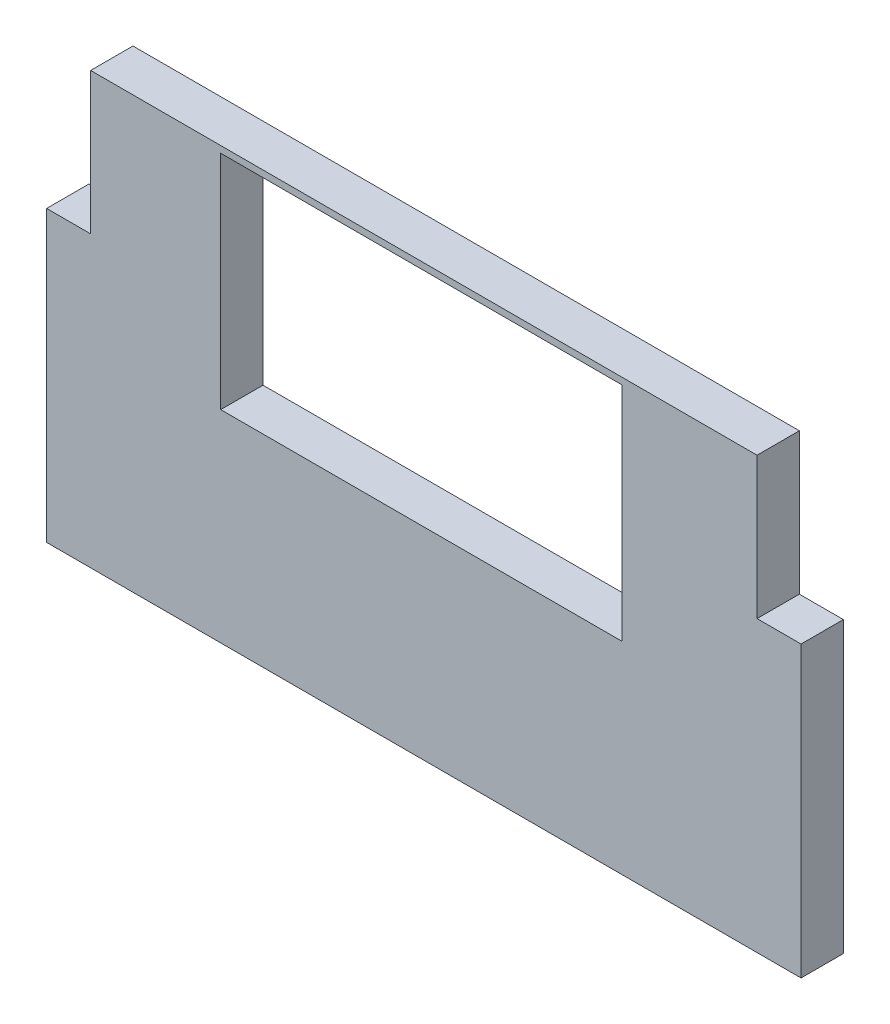
ISO-10303-21;
HEADER;
FILE_DESCRIPTION(('STEP AP214'),'2;1');
FILE_NAME('part.step','',(''),(''),'','','');
FILE_SCHEMA(('AUTOMOTIVE_DESIGN { 1 0 10303 214 1 1 1 1 }'));
ENDSEC;
DATA;
#1=APPLICATION_CONTEXT('core data for automotive mechanical design processes');
#2=APPLICATION_PROTOCOL_DEFINITION('international standard','automotive_design',2000,#1);
#3=PRODUCT_CONTEXT('',#1,'mechanical');
#4=PRODUCT('Part','Part','',(#3));
#5=PRODUCT_RELATED_PRODUCT_CATEGORY('part','',(#4));
#6=PRODUCT_DEFINITION_FORMATION('','',#4);
#7=PRODUCT_DEFINITION_CONTEXT('part definition',#1,'design');
#8=PRODUCT_DEFINITION('design','',#6,#7);
#9=PRODUCT_DEFINITION_SHAPE('','',#8);
#10=(LENGTH_UNIT() NAMED_UNIT(*) SI_UNIT(.MILLI.,.METRE.));
#11=(NAMED_UNIT(*) PLANE_ANGLE_UNIT() SI_UNIT($,.RADIAN.));
#12=(NAMED_UNIT(*) SI_UNIT($,.STERADIAN.) SOLID_ANGLE_UNIT());
#13=UNCERTAINTY_MEASURE_WITH_UNIT(LENGTH_MEASURE(1.E-05),#10,'distance_accuracy_value','');
#14=(GEOMETRIC_REPRESENTATION_CONTEXT(3) GLOBAL_UNCERTAINTY_ASSIGNED_CONTEXT((#13)) GLOBAL_UNIT_ASSIGNED_CONTEXT((#10,
#11,#12)) REPRESENTATION_CONTEXT('',''));
#15=CARTESIAN_POINT('',(0.,0.,0.));
#16=DIRECTION('',(0.,0.,1.));
#17=DIRECTION('',(1.,0.,0.));
#18=AXIS2_PLACEMENT_3D('',#15,#16,#17);
#19=CARTESIAN_POINT('',(0.,0.,3.175));
#20=DIRECTION('',(0.,0.,-1.));
#21=DIRECTION('',(-1.,0.,0.));
#22=AXIS2_PLACEMENT_3D('',#19,#20,#21);
#23=PLANE('',#22);
#24=DIRECTION('',(1.,0.,0.));
#25=VECTOR('',#24,1.);
#26=CARTESIAN_POINT('',(48.9804120830226,2.21128549851933,3.175));
#27=LINE('',#26,#25);
#28=CARTESIAN_POINT('',(-7.62358791697743,2.21128549851933,3.175));
#29=VERTEX_POINT('',#28);
#30=CARTESIAN_POINT('',(48.9804120830226,2.21128549851933,3.175));
#31=VERTEX_POINT('',#30);
#32=EDGE_CURVE('E177',#29,#31,#27,.T.);
#33=ORIENTED_EDGE('',*,*,#32,.T.);
#34=DIRECTION('',(0.,1.,0.));
#35=VECTOR('',#34,1.);
#36=CARTESIAN_POINT('',(48.9804120830226,23.9132855285193,3.175));
#37=LINE('',#36,#35);
#38=CARTESIAN_POINT('',(48.9804120830226,23.9132855285193,3.175));
#39=VERTEX_POINT('',#38);
#40=EDGE_CURVE('E181',#31,#39,#37,.T.);
#41=ORIENTED_EDGE('',*,*,#40,.T.);
#42=DIRECTION('',(-1.,0.,0.));
#43=VECTOR('',#42,1.);
#44=CARTESIAN_POINT('',(45.6784120830226,23.9132855285193,3.175));
#45=LINE('',#44,#43);
#46=CARTESIAN_POINT('',(45.6784120830226,23.9132855285193,3.175));
#47=VERTEX_POINT('',#46);
#48=EDGE_CURVE('E185',#39,#47,#45,.T.);
#49=ORIENTED_EDGE('',*,*,#48,.T.);
#50=DIRECTION('',(0.,1.,0.));
#51=VECTOR('',#50,1.);
#52=CARTESIAN_POINT('',(45.6784120830226,34.5312854985193,3.175));
#53=LINE('',#52,#51);
#54=CARTESIAN_POINT('',(45.6784120830226,34.5312854985193,3.175));
#55=VERTEX_POINT('',#54);
#56=EDGE_CURVE('E188',#47,#55,#53,.T.);
#57=ORIENTED_EDGE('',*,*,#56,.T.);
#58=DIRECTION('',(-1.,0.,0.));
#59=VECTOR('',#58,1.);
#60=CARTESIAN_POINT('',(-4.32158791697743,34.5312854985193,3.175));
#61=LINE('',#60,#59);
#62=CARTESIAN_POINT('',(-4.32158791697743,34.5312854985193,3.175));
#63=VERTEX_POINT('',#62);
#64=EDGE_CURVE('E191',#55,#63,#61,.T.);
#65=ORIENTED_EDGE('',*,*,#64,.T.);
#66=DIRECTION('',(0.,-1.,0.));
#67=VECTOR('',#66,1.);
#68=CARTESIAN_POINT('',(-4.32158791697743,23.9132855285193,3.175));
#69=LINE('',#68,#67);
#70=CARTESIAN_POINT('',(-4.32158791697743,23.9132855285193,3.175));
#71=VERTEX_POINT('',#70);
#72=EDGE_CURVE('E194',#63,#71,#69,.T.);
#73=ORIENTED_EDGE('',*,*,#72,.T.);
#74=DIRECTION('',(-1.,0.,0.));
#75=VECTOR('',#74,1.);
#76=CARTESIAN_POINT('',(-7.62358791697743,23.9132855285193,3.175));
#77=LINE('',#76,#75);
#78=CARTESIAN_POINT('',(-7.62358791697743,23.9132855285193,3.175));
#79=VERTEX_POINT('',#78);
#80=EDGE_CURVE('E197',#71,#79,#77,.T.);
#81=ORIENTED_EDGE('',*,*,#80,.T.);
#82=DIRECTION('',(0.,-1.,0.));
#83=VECTOR('',#82,1.);
#84=CARTESIAN_POINT('',(-7.62358791697743,2.21128549851933,3.175));
#85=LINE('',#84,#83);
#86=EDGE_CURVE('E200',#79,#29,#85,.T.);
#87=ORIENTED_EDGE('',*,*,#86,.T.);
#88=EDGE_LOOP('',(#33,#41,#49,#57,#65,#73,#81,#87));
#89=FACE_BOUND('',#88,.T.);
#90=DIRECTION('',(0.,-1.,0.));
#91=VECTOR('',#90,1.);
#92=CARTESIAN_POINT('',(5.43841208302234,34.0312854985174,3.175));
#93=LINE('',#92,#91);
#94=CARTESIAN_POINT('',(5.43841208302234,34.0312854985174,3.175));
#95=VERTEX_POINT('',#94);
#96=CARTESIAN_POINT('',(5.43841208302234,17.3712854985174,3.175));
#97=VERTEX_POINT('',#96);
#98=EDGE_CURVE('E129',#95,#97,#93,.T.);
#99=ORIENTED_EDGE('',*,*,#98,.F.);
#100=DIRECTION('',(-1.,0.,0.));
#101=VECTOR('',#100,1.);
#102=CARTESIAN_POINT('',(5.43841208302234,34.0312854985174,3.175));
#103=LINE('',#102,#101);
#104=CARTESIAN_POINT('',(35.5384120830223,34.0312854985174,3.175));
#105=VERTEX_POINT('',#104);
#106=EDGE_CURVE('E155',#105,#95,#103,.T.);
#107=ORIENTED_EDGE('',*,*,#106,.F.);
#108=DIRECTION('',(0.,1.,0.));
#109=VECTOR('',#108,1.);
#110=CARTESIAN_POINT('',(35.5384120830223,34.0312854985174,3.175));
#111=LINE('',#110,#109);
#112=CARTESIAN_POINT('',(35.5384120830223,17.3712854985174,3.175));
#113=VERTEX_POINT('',#112);
#114=EDGE_CURVE('E151',#113,#105,#111,.T.);
#115=ORIENTED_EDGE('',*,*,#114,.F.);
#116=DIRECTION('',(1.,0.,0.));
#117=VECTOR('',#116,1.);
#118=CARTESIAN_POINT('',(5.43841208302234,17.3712854985174,3.175));
#119=LINE('',#118,#117);
#120=EDGE_CURVE('E138',#97,#113,#119,.T.);
#121=ORIENTED_EDGE('',*,*,#120,.F.);
#122=EDGE_LOOP('',(#99,#107,#115,#121));
#123=FACE_BOUND('',#122,.T.);
#124=ADVANCED_FACE('F39',(#89,#123),#23,.F.);
#125=CARTESIAN_POINT('',(0.,0.,0.));
#126=DIRECTION('',(0.,0.,-1.));
#127=DIRECTION('',(-1.,0.,0.));
#128=AXIS2_PLACEMENT_3D('',#125,#126,#127);
#129=PLANE('',#128);
#130=DIRECTION('',(1.,0.,0.));
#131=VECTOR('',#130,1.);
#132=CARTESIAN_POINT('',(48.9804120830226,2.21128549851933,0.));
#133=LINE('',#132,#131);
#134=CARTESIAN_POINT('',(-7.62358791697743,2.21128549851933,0.));
#135=VERTEX_POINT('',#134);
#136=CARTESIAN_POINT('',(48.9804120830226,2.21128549851933,0.));
#137=VERTEX_POINT('',#136);
#138=EDGE_CURVE('E147',#135,#137,#133,.T.);
#139=ORIENTED_EDGE('',*,*,#138,.F.);
#140=DIRECTION('',(0.,-1.,0.));
#141=VECTOR('',#140,1.);
#142=CARTESIAN_POINT('',(-7.62358791697743,2.21128549851933,0.));
#143=LINE('',#142,#141);
#144=CARTESIAN_POINT('',(-7.62358791697743,23.9132855285193,0.));
#145=VERTEX_POINT('',#144);
#146=EDGE_CURVE('E182',#145,#135,#143,.T.);
#147=ORIENTED_EDGE('',*,*,#146,.F.);
#148=DIRECTION('',(-1.,0.,0.));
#149=VECTOR('',#148,1.);
#150=CARTESIAN_POINT('',(-7.62358791697743,23.9132855285193,0.));
#151=LINE('',#150,#149);
#152=CARTESIAN_POINT('',(-4.32158791697743,23.9132855285193,0.));
#153=VERTEX_POINT('',#152);
#154=EDGE_CURVE('E222',#153,#145,#151,.T.);
#155=ORIENTED_EDGE('',*,*,#154,.F.);
#156=DIRECTION('',(0.,-1.,0.));
#157=VECTOR('',#156,1.);
#158=CARTESIAN_POINT('',(-4.32158791697743,23.9132855285193,0.));
#159=LINE('',#158,#157);
#160=CARTESIAN_POINT('',(-4.32158791697743,34.5312854985193,0.));
#161=VERTEX_POINT('',#160);
#162=EDGE_CURVE('E219',#161,#153,#159,.T.);
#163=ORIENTED_EDGE('',*,*,#162,.F.);
#164=DIRECTION('',(-1.,0.,0.));
#165=VECTOR('',#164,1.);
#166=CARTESIAN_POINT('',(-4.32158791697743,34.5312854985193,0.));
#167=LINE('',#166,#165);
#168=CARTESIAN_POINT('',(45.6784120830226,34.5312854985193,0.));
#169=VERTEX_POINT('',#168);
#170=EDGE_CURVE('E216',#169,#161,#167,.T.);
#171=ORIENTED_EDGE('',*,*,#170,.F.);
#172=DIRECTION('',(0.,1.,0.));
#173=VECTOR('',#172,1.);
#174=CARTESIAN_POINT('',(45.6784120830226,34.5312854985193,0.));
#175=LINE('',#174,#173);
#176=CARTESIAN_POINT('',(45.6784120830226,23.9132855285193,0.));
#177=VERTEX_POINT('',#176);
#178=EDGE_CURVE('E213',#177,#169,#175,.T.);
#179=ORIENTED_EDGE('',*,*,#178,.F.);
#180=DIRECTION('',(-1.,0.,0.));
#181=VECTOR('',#180,1.);
#182=CARTESIAN_POINT('',(45.6784120830226,23.9132855285193,0.));
#183=LINE('',#182,#181);
#184=CARTESIAN_POINT('',(48.9804120830226,23.9132855285193,0.));
#185=VERTEX_POINT('',#184);
#186=EDGE_CURVE('E210',#185,#177,#183,.T.);
#187=ORIENTED_EDGE('',*,*,#186,.F.);
#188=DIRECTION('',(0.,1.,0.));
#189=VECTOR('',#188,1.);
#190=CARTESIAN_POINT('',(48.9804120830226,23.9132855285193,0.));
#191=LINE('',#190,#189);
#192=EDGE_CURVE('E207',#137,#185,#191,.T.);
#193=ORIENTED_EDGE('',*,*,#192,.F.);
#194=EDGE_LOOP('',(#139,#147,#155,#163,#171,#179,#187,#193));
#195=FACE_BOUND('',#194,.T.);
#196=DIRECTION('',(-1.,0.,0.));
#197=VECTOR('',#196,1.);
#198=CARTESIAN_POINT('',(5.43841208302234,34.0312854985174,0.));
#199=LINE('',#198,#197);
#200=CARTESIAN_POINT('',(35.5384120830223,34.0312854985174,0.));
#201=VERTEX_POINT('',#200);
#202=CARTESIAN_POINT('',(5.43841208302234,34.0312854985174,0.));
#203=VERTEX_POINT('',#202);
#204=EDGE_CURVE('E139',#201,#203,#199,.T.);
#205=ORIENTED_EDGE('',*,*,#204,.T.);
#206=DIRECTION('',(0.,-1.,0.));
#207=VECTOR('',#206,1.);
#208=CARTESIAN_POINT('',(5.43841208302234,34.0312854985174,0.));
#209=LINE('',#208,#207);
#210=CARTESIAN_POINT('',(5.43841208302234,17.3712854985174,0.));
#211=VERTEX_POINT('',#210);
#212=EDGE_CURVE('E63',#203,#211,#209,.T.);
#213=ORIENTED_EDGE('',*,*,#212,.T.);
#214=DIRECTION('',(1.,0.,0.));
#215=VECTOR('',#214,1.);
#216=CARTESIAN_POINT('',(5.43841208302234,17.3712854985174,0.));
#217=LINE('',#216,#215);
#218=CARTESIAN_POINT('',(35.5384120830223,17.3712854985174,0.));
#219=VERTEX_POINT('',#218);
#220=EDGE_CURVE('E145',#211,#219,#217,.T.);
#221=ORIENTED_EDGE('',*,*,#220,.T.);
#222=DIRECTION('',(0.,1.,0.));
#223=VECTOR('',#222,1.);
#224=CARTESIAN_POINT('',(35.5384120830223,34.0312854985174,0.));
#225=LINE('',#224,#223);
#226=EDGE_CURVE('E164',#219,#201,#225,.T.);
#227=ORIENTED_EDGE('',*,*,#226,.T.);
#228=EDGE_LOOP('',(#205,#213,#221,#227));
#229=FACE_BOUND('',#228,.T.);
#230=ADVANCED_FACE('F261',(#195,#229),#129,.T.);
#231=CARTESIAN_POINT('',(48.9804120830226,2.21128549851933,3.175));
#232=DIRECTION('',(0.,1.,0.));
#233=DIRECTION('',(-1.,0.,0.));
#234=AXIS2_PLACEMENT_3D('',#231,#232,#233);
#235=PLANE('',#234);
#236=ORIENTED_EDGE('',*,*,#138,.T.);
#237=DIRECTION('',(0.,0.,-1.));
#238=VECTOR('',#237,1.);
#239=CARTESIAN_POINT('',(48.9804120830226,2.21128549851933,3.175));
#240=LINE('',#239,#238);
#241=EDGE_CURVE('E11',#31,#137,#240,.T.);
#242=ORIENTED_EDGE('',*,*,#241,.F.);
#243=ORIENTED_EDGE('',*,*,#32,.F.);
#244=DIRECTION('',(0.,0.,-1.));
#245=VECTOR('',#244,1.);
#246=CARTESIAN_POINT('',(-7.62358791697743,2.21128549851933,3.175));
#247=LINE('',#246,#245);
#248=EDGE_CURVE('E203',#29,#135,#247,.T.);
#249=ORIENTED_EDGE('',*,*,#248,.T.);
#250=EDGE_LOOP('',(#236,#242,#243,#249));
#251=FACE_BOUND('',#250,.T.);
#252=ADVANCED_FACE('F41',(#251),#235,.F.);
#253=CARTESIAN_POINT('',(48.9804120830226,23.9132855285193,3.175));
#254=DIRECTION('',(-1.,0.,0.));
#255=DIRECTION('',(0.,0.,1.));
#256=AXIS2_PLACEMENT_3D('',#253,#254,#255);
#257=PLANE('',#256);
#258=ORIENTED_EDGE('',*,*,#192,.T.);
#259=DIRECTION('',(0.,0.,-1.));
#260=VECTOR('',#259,1.);
#261=CARTESIAN_POINT('',(48.9804120830226,23.9132855285193,3.175));
#262=LINE('',#261,#260);
#263=EDGE_CURVE('E48',#39,#185,#262,.T.);
#264=ORIENTED_EDGE('',*,*,#263,.F.);
#265=ORIENTED_EDGE('',*,*,#40,.F.);
#266=ORIENTED_EDGE('',*,*,#241,.T.);
#267=EDGE_LOOP('',(#258,#264,#265,#266));
#268=FACE_BOUND('',#267,.T.);
#269=ADVANCED_FACE('F278',(#268),#257,.F.);
#270=CARTESIAN_POINT('',(45.6784120830226,23.9132855285193,3.175));
#271=DIRECTION('',(0.,-1.,0.));
#272=DIRECTION('',(0.,0.,-1.));
#273=AXIS2_PLACEMENT_3D('',#270,#271,#272);
#274=PLANE('',#273);
#275=ORIENTED_EDGE('',*,*,#186,.T.);
#276=DIRECTION('',(0.,0.,-1.));
#277=VECTOR('',#276,1.);
#278=CARTESIAN_POINT('',(45.6784120830226,23.9132855285193,3.175));
#279=LINE('',#278,#277);
#280=EDGE_CURVE('E246',#47,#177,#279,.T.);
#281=ORIENTED_EDGE('',*,*,#280,.F.);
#282=ORIENTED_EDGE('',*,*,#48,.F.);
#283=ORIENTED_EDGE('',*,*,#263,.T.);
#284=EDGE_LOOP('',(#275,#281,#282,#283));
#285=FACE_BOUND('',#284,.T.);
#286=ADVANCED_FACE('F255',(#285),#274,.F.);
#287=CARTESIAN_POINT('',(45.6784120830226,34.5312854985193,3.175));
#288=DIRECTION('',(-1.,0.,0.));
#289=DIRECTION('',(0.,0.,1.));
#290=AXIS2_PLACEMENT_3D('',#287,#288,#289);
#291=PLANE('',#290);
#292=ORIENTED_EDGE('',*,*,#178,.T.);
#293=DIRECTION('',(0.,0.,-1.));
#294=VECTOR('',#293,1.);
#295=CARTESIAN_POINT('',(45.6784120830226,34.5312854985193,3.175));
#296=LINE('',#295,#294);
#297=EDGE_CURVE('E242',#55,#169,#296,.T.);
#298=ORIENTED_EDGE('',*,*,#297,.F.);
#299=ORIENTED_EDGE('',*,*,#56,.F.);
#300=ORIENTED_EDGE('',*,*,#280,.T.);
#301=EDGE_LOOP('',(#292,#298,#299,#300));
#302=FACE_BOUND('',#301,.T.);
#303=ADVANCED_FACE('F267',(#302),#291,.F.);
#304=CARTESIAN_POINT('',(-4.32158791697743,34.5312854985193,3.175));
#305=DIRECTION('',(0.,-1.,0.));
#306=DIRECTION('',(0.,0.,-1.));
#307=AXIS2_PLACEMENT_3D('',#304,#305,#306);
#308=PLANE('',#307);
#309=ORIENTED_EDGE('',*,*,#170,.T.);
#310=DIRECTION('',(0.,0.,-1.));
#311=VECTOR('',#310,1.);
#312=CARTESIAN_POINT('',(-4.32158791697743,34.5312854985193,3.175));
#313=LINE('',#312,#311);
#314=EDGE_CURVE('E238',#63,#161,#313,.T.);
#315=ORIENTED_EDGE('',*,*,#314,.F.);
#316=ORIENTED_EDGE('',*,*,#64,.F.);
#317=ORIENTED_EDGE('',*,*,#297,.T.);
#318=EDGE_LOOP('',(#309,#315,#316,#317));
#319=FACE_BOUND('',#318,.T.);
#320=ADVANCED_FACE('F271',(#319),#308,.F.);
#321=CARTESIAN_POINT('',(-4.32158791697743,23.9132855285193,3.175));
#322=DIRECTION('',(1.,0.,0.));
#323=DIRECTION('',(0.,0.,-1.));
#324=AXIS2_PLACEMENT_3D('',#321,#322,#323);
#325=PLANE('',#324);
#326=ORIENTED_EDGE('',*,*,#162,.T.);
#327=DIRECTION('',(0.,0.,-1.));
#328=VECTOR('',#327,1.);
#329=CARTESIAN_POINT('',(-4.32158791697743,23.9132855285193,3.175));
#330=LINE('',#329,#328);
#331=EDGE_CURVE('E234',#71,#153,#330,.T.);
#332=ORIENTED_EDGE('',*,*,#331,.F.);
#333=ORIENTED_EDGE('',*,*,#72,.F.);
#334=ORIENTED_EDGE('',*,*,#314,.T.);
#335=EDGE_LOOP('',(#326,#332,#333,#334));
#336=FACE_BOUND('',#335,.T.);
#337=ADVANCED_FACE('F291',(#336),#325,.F.);
#338=CARTESIAN_POINT('',(-7.62358791697743,23.9132855285193,3.175));
#339=DIRECTION('',(0.,-1.,0.));
#340=DIRECTION('',(0.,0.,-1.));
#341=AXIS2_PLACEMENT_3D('',#338,#339,#340);
#342=PLANE('',#341);
#343=ORIENTED_EDGE('',*,*,#154,.T.);
#344=DIRECTION('',(0.,0.,-1.));
#345=VECTOR('',#344,1.);
#346=CARTESIAN_POINT('',(-7.62358791697743,23.9132855285193,3.175));
#347=LINE('',#346,#345);
#348=EDGE_CURVE('E230',#79,#145,#347,.T.);
#349=ORIENTED_EDGE('',*,*,#348,.F.);
#350=ORIENTED_EDGE('',*,*,#80,.F.);
#351=ORIENTED_EDGE('',*,*,#331,.T.);
#352=EDGE_LOOP('',(#343,#349,#350,#351));
#353=FACE_BOUND('',#352,.T.);
#354=ADVANCED_FACE('F289',(#353),#342,.F.);
#355=CARTESIAN_POINT('',(-7.62358791697743,2.21128549851933,3.175));
#356=DIRECTION('',(1.,0.,0.));
#357=DIRECTION('',(0.,1.,0.));
#358=AXIS2_PLACEMENT_3D('',#355,#356,#357);
#359=PLANE('',#358);
#360=ORIENTED_EDGE('',*,*,#146,.T.);
#361=ORIENTED_EDGE('',*,*,#248,.F.);
#362=ORIENTED_EDGE('',*,*,#86,.F.);
#363=ORIENTED_EDGE('',*,*,#348,.T.);
#364=EDGE_LOOP('',(#360,#361,#362,#363));
#365=FACE_BOUND('',#364,.T.);
#366=ADVANCED_FACE('F284',(#365),#359,.F.);
#367=CARTESIAN_POINT('',(5.43841208302234,34.0312854985174,3.175));
#368=DIRECTION('',(1.,0.,0.));
#369=DIRECTION('',(0.,1.,0.));
#370=AXIS2_PLACEMENT_3D('',#367,#368,#369);
#371=PLANE('',#370);
#372=ORIENTED_EDGE('',*,*,#212,.F.);
#373=DIRECTION('',(0.,0.,-1.));
#374=VECTOR('',#373,1.);
#375=CARTESIAN_POINT('',(5.43841208302234,34.0312854985174,3.175));
#376=LINE('',#375,#374);
#377=EDGE_CURVE('E133',#95,#203,#376,.T.);
#378=ORIENTED_EDGE('',*,*,#377,.F.);
#379=ORIENTED_EDGE('',*,*,#98,.T.);
#380=DIRECTION('',(0.,0.,-1.));
#381=VECTOR('',#380,1.);
#382=CARTESIAN_POINT('',(5.43841208302234,17.3712854985174,3.175));
#383=LINE('',#382,#381);
#384=EDGE_CURVE('E132',#97,#211,#383,.T.);
#385=ORIENTED_EDGE('',*,*,#384,.T.);
#386=EDGE_LOOP('',(#372,#378,#379,#385));
#387=FACE_BOUND('',#386,.T.);
#388=ADVANCED_FACE('F131',(#387),#371,.T.);
#389=CARTESIAN_POINT('',(5.43841208302234,17.3712854985174,3.175));
#390=DIRECTION('',(0.,1.,0.));
#391=DIRECTION('',(0.,0.,1.));
#392=AXIS2_PLACEMENT_3D('',#389,#390,#391);
#393=PLANE('',#392);
#394=ORIENTED_EDGE('',*,*,#220,.F.);
#395=ORIENTED_EDGE('',*,*,#384,.F.);
#396=ORIENTED_EDGE('',*,*,#120,.T.);
#397=DIRECTION('',(0.,0.,-1.));
#398=VECTOR('',#397,1.);
#399=CARTESIAN_POINT('',(35.5384120830223,17.3712854985174,3.175));
#400=LINE('',#399,#398);
#401=EDGE_CURVE('E148',#113,#219,#400,.T.);
#402=ORIENTED_EDGE('',*,*,#401,.T.);
#403=EDGE_LOOP('',(#394,#395,#396,#402));
#404=FACE_BOUND('',#403,.T.);
#405=ADVANCED_FACE('F142',(#404),#393,.T.);
#406=CARTESIAN_POINT('',(35.5384120830223,34.0312854985174,3.175));
#407=DIRECTION('',(-1.,0.,0.));
#408=DIRECTION('',(0.,-1.,0.));
#409=AXIS2_PLACEMENT_3D('',#406,#407,#408);
#410=PLANE('',#409);
#411=ORIENTED_EDGE('',*,*,#226,.F.);
#412=ORIENTED_EDGE('',*,*,#401,.F.);
#413=ORIENTED_EDGE('',*,*,#114,.T.);
#414=DIRECTION('',(0.,0.,-1.));
#415=VECTOR('',#414,1.);
#416=CARTESIAN_POINT('',(35.5384120830223,34.0312854985174,3.175));
#417=LINE('',#416,#415);
#418=EDGE_CURVE('E55',#105,#201,#417,.T.);
#419=ORIENTED_EDGE('',*,*,#418,.T.);
#420=EDGE_LOOP('',(#411,#412,#413,#419));
#421=FACE_BOUND('',#420,.T.);
#422=ADVANCED_FACE('F316',(#421),#410,.T.);
#423=CARTESIAN_POINT('',(5.43841208302234,34.0312854985174,3.175));
#424=DIRECTION('',(0.,-1.,0.));
#425=DIRECTION('',(0.,0.,-1.));
#426=AXIS2_PLACEMENT_3D('',#423,#424,#425);
#427=PLANE('',#426);
#428=ORIENTED_EDGE('',*,*,#204,.F.);
#429=ORIENTED_EDGE('',*,*,#418,.F.);
#430=ORIENTED_EDGE('',*,*,#106,.T.);
#431=ORIENTED_EDGE('',*,*,#377,.T.);
#432=EDGE_LOOP('',(#428,#429,#430,#431));
#433=FACE_BOUND('',#432,.T.);
#434=ADVANCED_FACE('F320',(#433),#427,.T.);
#435=CLOSED_SHELL('',(#124,#230,#252,#269,#286,#303,#320,#337,#354,#366,#388,#405,#422,#434));
#436=MANIFOLD_SOLID_BREP('B2',#435);
#437=ADVANCED_BREP_SHAPE_REPRESENTATION('',(#18,#436),#14);
#438=SHAPE_DEFINITION_REPRESENTATION(#9,#437);
ENDSEC;
END-ISO-10303-21;
